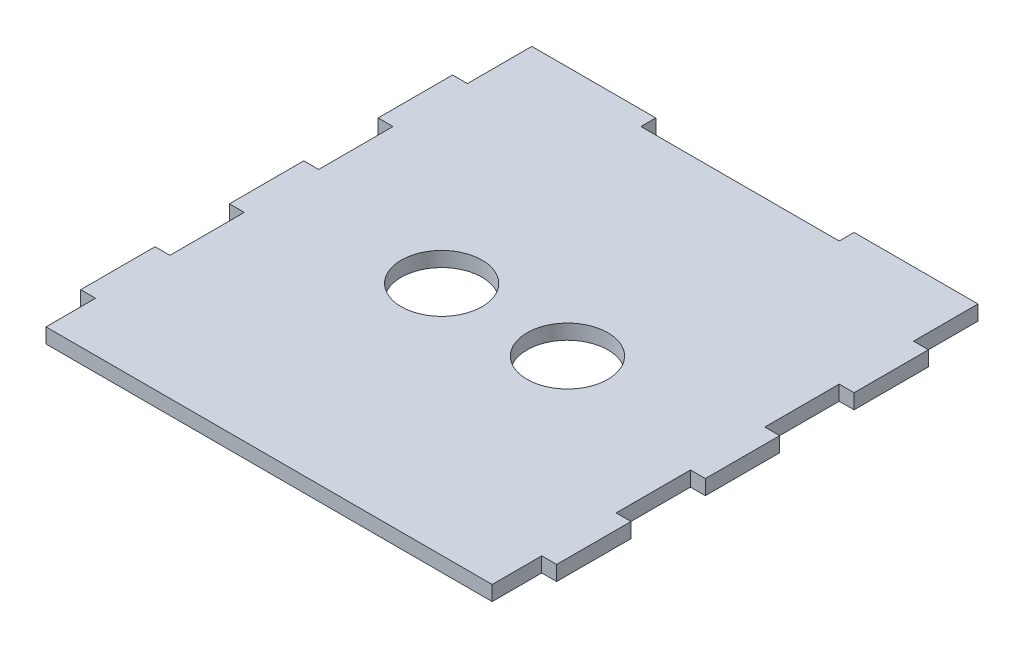
ISO-10303-21;
HEADER;
FILE_DESCRIPTION(('STEP AP214'),'2;1');
FILE_NAME('part.step','',(''),(''),'','','');
FILE_SCHEMA(('AUTOMOTIVE_DESIGN { 1 0 10303 214 1 1 1 1 }'));
ENDSEC;
DATA;
#1=APPLICATION_CONTEXT('core data for automotive mechanical design processes');
#2=APPLICATION_PROTOCOL_DEFINITION('international standard','automotive_design',2000,#1);
#3=PRODUCT_CONTEXT('',#1,'mechanical');
#4=PRODUCT('Part','Part','',(#3));
#5=PRODUCT_RELATED_PRODUCT_CATEGORY('part','',(#4));
#6=PRODUCT_DEFINITION_FORMATION('','',#4);
#7=PRODUCT_DEFINITION_CONTEXT('part definition',#1,'design');
#8=PRODUCT_DEFINITION('design','',#6,#7);
#9=PRODUCT_DEFINITION_SHAPE('','',#8);
#10=(LENGTH_UNIT() NAMED_UNIT(*) SI_UNIT(.MILLI.,.METRE.));
#11=(NAMED_UNIT(*) PLANE_ANGLE_UNIT() SI_UNIT($,.RADIAN.));
#12=(NAMED_UNIT(*) SI_UNIT($,.STERADIAN.) SOLID_ANGLE_UNIT());
#13=UNCERTAINTY_MEASURE_WITH_UNIT(LENGTH_MEASURE(1.E-05),#10,'distance_accuracy_value','');
#14=(GEOMETRIC_REPRESENTATION_CONTEXT(3) GLOBAL_UNCERTAINTY_ASSIGNED_CONTEXT((#13)) GLOBAL_UNIT_ASSIGNED_CONTEXT((#10,
#11,#12)) REPRESENTATION_CONTEXT('',''));
#15=CARTESIAN_POINT('',(0.,0.,0.));
#16=DIRECTION('',(0.,0.,1.));
#17=DIRECTION('',(1.,0.,0.));
#18=AXIS2_PLACEMENT_3D('',#15,#16,#17);
#19=CARTESIAN_POINT('',(0.,0.,-98.));
#20=DIRECTION('',(0.,0.,-1.));
#21=DIRECTION('',(-1.,0.,0.));
#22=AXIS2_PLACEMENT_3D('',#19,#20,#21);
#23=PLANE('',#22);
#24=DIRECTION('',(0.,1.,0.));
#25=VECTOR('',#24,1.);
#26=CARTESIAN_POINT('',(25.,0.,-98.));
#27=LINE('',#26,#25);
#28=CARTESIAN_POINT('',(25.,0.,-98.));
#29=VERTEX_POINT('',#28);
#30=CARTESIAN_POINT('',(25.,3.,-98.));
#31=VERTEX_POINT('',#30);
#32=EDGE_CURVE('E43',#29,#31,#27,.T.);
#33=ORIENTED_EDGE('',*,*,#32,.F.);
#34=DIRECTION('',(-1.,0.,0.));
#35=VECTOR('',#34,1.);
#36=CARTESIAN_POINT('',(0.,0.,-98.));
#37=LINE('',#36,#35);
#38=CARTESIAN_POINT('',(0.,0.,-98.));
#39=VERTEX_POINT('',#38);
#40=EDGE_CURVE('E281',#29,#39,#37,.T.);
#41=ORIENTED_EDGE('',*,*,#40,.T.);
#42=DIRECTION('',(0.,1.,0.));
#43=VECTOR('',#42,1.);
#44=CARTESIAN_POINT('',(0.,0.,-98.));
#45=LINE('',#44,#43);
#46=CARTESIAN_POINT('',(0.,3.,-98.));
#47=VERTEX_POINT('',#46);
#48=EDGE_CURVE('E284',#39,#47,#45,.T.);
#49=ORIENTED_EDGE('',*,*,#48,.T.);
#50=DIRECTION('',(-1.,0.,0.));
#51=VECTOR('',#50,1.);
#52=CARTESIAN_POINT('',(0.,3.,-98.));
#53=LINE('',#52,#51);
#54=EDGE_CURVE('E276',#31,#47,#53,.T.);
#55=ORIENTED_EDGE('',*,*,#54,.F.);
#56=EDGE_LOOP('',(#33,#41,#49,#55));
#57=FACE_BOUND('',#56,.T.);
#58=ADVANCED_FACE('F34',(#57),#23,.T.);
#59=CARTESIAN_POINT('',(90.,3.,0.));
#60=DIRECTION('',(-1.,0.,0.));
#61=DIRECTION('',(0.,0.,1.));
#62=AXIS2_PLACEMENT_3D('',#59,#60,#61);
#63=PLANE('',#62);
#64=DIRECTION('',(0.,0.,-1.));
#65=VECTOR('',#64,1.);
#66=CARTESIAN_POINT('',(90.,3.,0.));
#67=LINE('',#66,#65);
#68=CARTESIAN_POINT('',(90.,3.,-25.));
#69=VERTEX_POINT('',#68);
#70=CARTESIAN_POINT('',(90.,3.,-40.));
#71=VERTEX_POINT('',#70);
#72=EDGE_CURVE('E59',#69,#71,#67,.T.);
#73=ORIENTED_EDGE('',*,*,#72,.F.);
#74=DIRECTION('',(0.,1.,0.));
#75=VECTOR('',#74,1.);
#76=CARTESIAN_POINT('',(90.,0.,-25.));
#77=LINE('',#76,#75);
#78=CARTESIAN_POINT('',(90.,0.,-25.));
#79=VERTEX_POINT('',#78);
#80=EDGE_CURVE('E308',#79,#69,#77,.T.);
#81=ORIENTED_EDGE('',*,*,#80,.F.);
#82=DIRECTION('',(0.,0.,-1.));
#83=VECTOR('',#82,1.);
#84=CARTESIAN_POINT('',(90.,0.,0.));
#85=LINE('',#84,#83);
#86=CARTESIAN_POINT('',(90.,0.,-40.));
#87=VERTEX_POINT('',#86);
#88=EDGE_CURVE('E374',#79,#87,#85,.T.);
#89=ORIENTED_EDGE('',*,*,#88,.T.);
#90=DIRECTION('',(0.,1.,0.));
#91=VECTOR('',#90,1.);
#92=CARTESIAN_POINT('',(90.,0.,-40.));
#93=LINE('',#92,#91);
#94=EDGE_CURVE('E326',#87,#71,#93,.T.);
#95=ORIENTED_EDGE('',*,*,#94,.T.);
#96=EDGE_LOOP('',(#73,#81,#89,#95));
#97=FACE_BOUND('',#96,.T.);
#98=ADVANCED_FACE('F510',(#97),#63,.F.);
#99=CARTESIAN_POINT('',(90.,3.,-55.));
#100=VERTEX_POINT('',#99);
#101=CARTESIAN_POINT('',(90.,3.,-70.));
#102=VERTEX_POINT('',#101);
#103=EDGE_CURVE('E376',#100,#102,#67,.T.);
#104=ORIENTED_EDGE('',*,*,#103,.F.);
#105=DIRECTION('',(0.,1.,0.));
#106=VECTOR('',#105,1.);
#107=CARTESIAN_POINT('',(90.,0.,-55.));
#108=LINE('',#107,#106);
#109=CARTESIAN_POINT('',(90.,0.,-55.));
#110=VERTEX_POINT('',#109);
#111=EDGE_CURVE('E334',#110,#100,#108,.T.);
#112=ORIENTED_EDGE('',*,*,#111,.F.);
#113=CARTESIAN_POINT('',(90.,0.,-70.));
#114=VERTEX_POINT('',#113);
#115=EDGE_CURVE('E371',#110,#114,#85,.T.);
#116=ORIENTED_EDGE('',*,*,#115,.T.);
#117=DIRECTION('',(0.,1.,0.));
#118=VECTOR('',#117,1.);
#119=CARTESIAN_POINT('',(90.,0.,-70.));
#120=LINE('',#119,#118);
#121=EDGE_CURVE('E364',#114,#102,#120,.T.);
#122=ORIENTED_EDGE('',*,*,#121,.T.);
#123=EDGE_LOOP('',(#104,#112,#116,#122));
#124=FACE_BOUND('',#123,.T.);
#125=ADVANCED_FACE('F516',(#124),#63,.F.);
#126=DIRECTION('',(0.,1.,0.));
#127=VECTOR('',#126,1.);
#128=CARTESIAN_POINT('',(90.,0.,-85.));
#129=LINE('',#128,#127);
#130=CARTESIAN_POINT('',(90.,0.,-85.));
#131=VERTEX_POINT('',#130);
#132=CARTESIAN_POINT('',(90.,3.,-85.));
#133=VERTEX_POINT('',#132);
#134=EDGE_CURVE('E357',#131,#133,#129,.T.);
#135=ORIENTED_EDGE('',*,*,#134,.F.);
#136=CARTESIAN_POINT('',(90.,0.,-98.));
#137=VERTEX_POINT('',#136);
#138=EDGE_CURVE('E375',#131,#137,#85,.T.);
#139=ORIENTED_EDGE('',*,*,#138,.T.);
#140=DIRECTION('',(0.,1.,0.));
#141=VECTOR('',#140,1.);
#142=CARTESIAN_POINT('',(90.,0.,-98.));
#143=LINE('',#142,#141);
#144=CARTESIAN_POINT('',(90.,3.,-98.));
#145=VERTEX_POINT('',#144);
#146=EDGE_CURVE('E280',#137,#145,#143,.T.);
#147=ORIENTED_EDGE('',*,*,#146,.T.);
#148=EDGE_CURVE('E444',#133,#145,#67,.T.);
#149=ORIENTED_EDGE('',*,*,#148,.F.);
#150=EDGE_LOOP('',(#135,#139,#147,#149));
#151=FACE_BOUND('',#150,.T.);
#152=ADVANCED_FACE('F537',(#151),#63,.F.);
#153=CARTESIAN_POINT('',(0.,3.,0.));
#154=DIRECTION('',(-1.,0.,0.));
#155=DIRECTION('',(0.,0.,1.));
#156=AXIS2_PLACEMENT_3D('',#153,#154,#155);
#157=PLANE('',#156);
#158=DIRECTION('',(0.,1.,0.));
#159=VECTOR('',#158,1.);
#160=CARTESIAN_POINT('',(0.,0.,-25.));
#161=LINE('',#160,#159);
#162=CARTESIAN_POINT('',(0.,0.,-25.));
#163=VERTEX_POINT('',#162);
#164=CARTESIAN_POINT('',(0.,3.,-25.));
#165=VERTEX_POINT('',#164);
#166=EDGE_CURVE('E885',#163,#165,#161,.T.);
#167=ORIENTED_EDGE('',*,*,#166,.T.);
#168=DIRECTION('',(0.,0.,-1.));
#169=VECTOR('',#168,1.);
#170=CARTESIAN_POINT('',(0.,3.,0.));
#171=LINE('',#170,#169);
#172=CARTESIAN_POINT('',(0.,3.,-40.));
#173=VERTEX_POINT('',#172);
#174=EDGE_CURVE('E395',#165,#173,#171,.T.);
#175=ORIENTED_EDGE('',*,*,#174,.T.);
#176=DIRECTION('',(0.,1.,0.));
#177=VECTOR('',#176,1.);
#178=CARTESIAN_POINT('',(0.,0.,-40.));
#179=LINE('',#178,#177);
#180=CARTESIAN_POINT('',(0.,0.,-40.));
#181=VERTEX_POINT('',#180);
#182=EDGE_CURVE('E854',#181,#173,#179,.T.);
#183=ORIENTED_EDGE('',*,*,#182,.F.);
#184=DIRECTION('',(0.,0.,-1.));
#185=VECTOR('',#184,1.);
#186=CARTESIAN_POINT('',(0.,0.,0.));
#187=LINE('',#186,#185);
#188=EDGE_CURVE('E399',#163,#181,#187,.T.);
#189=ORIENTED_EDGE('',*,*,#188,.F.);
#190=EDGE_LOOP('',(#167,#175,#183,#189));
#191=FACE_BOUND('',#190,.T.);
#192=ADVANCED_FACE('F507',(#191),#157,.T.);
#193=DIRECTION('',(0.,1.,0.));
#194=VECTOR('',#193,1.);
#195=CARTESIAN_POINT('',(0.,0.,-55.));
#196=LINE('',#195,#194);
#197=CARTESIAN_POINT('',(0.,0.,-55.));
#198=VERTEX_POINT('',#197);
#199=CARTESIAN_POINT('',(0.,3.,-55.));
#200=VERTEX_POINT('',#199);
#201=EDGE_CURVE('E858',#198,#200,#196,.T.);
#202=ORIENTED_EDGE('',*,*,#201,.T.);
#203=CARTESIAN_POINT('',(0.,3.,-70.));
#204=VERTEX_POINT('',#203);
#205=EDGE_CURVE('E398',#200,#204,#171,.T.);
#206=ORIENTED_EDGE('',*,*,#205,.T.);
#207=DIRECTION('',(0.,1.,0.));
#208=VECTOR('',#207,1.);
#209=CARTESIAN_POINT('',(0.,0.,-70.));
#210=LINE('',#209,#208);
#211=CARTESIAN_POINT('',(0.,0.,-70.));
#212=VERTEX_POINT('',#211);
#213=EDGE_CURVE('E429',#212,#204,#210,.T.);
#214=ORIENTED_EDGE('',*,*,#213,.F.);
#215=EDGE_CURVE('E413',#198,#212,#187,.T.);
#216=ORIENTED_EDGE('',*,*,#215,.F.);
#217=EDGE_LOOP('',(#202,#206,#214,#216));
#218=FACE_BOUND('',#217,.T.);
#219=ADVANCED_FACE('F603',(#218),#157,.T.);
#220=CARTESIAN_POINT('',(0.,0.,-85.));
#221=VERTEX_POINT('',#220);
#222=EDGE_CURVE('E394',#221,#39,#187,.T.);
#223=ORIENTED_EDGE('',*,*,#222,.F.);
#224=DIRECTION('',(0.,1.,0.));
#225=VECTOR('',#224,1.);
#226=CARTESIAN_POINT('',(0.,0.,-85.));
#227=LINE('',#226,#225);
#228=CARTESIAN_POINT('',(0.,3.,-85.));
#229=VERTEX_POINT('',#228);
#230=EDGE_CURVE('E433',#221,#229,#227,.T.);
#231=ORIENTED_EDGE('',*,*,#230,.T.);
#232=EDGE_CURVE('E407',#229,#47,#171,.T.);
#233=ORIENTED_EDGE('',*,*,#232,.T.);
#234=ORIENTED_EDGE('',*,*,#48,.F.);
#235=EDGE_LOOP('',(#223,#231,#233,#234));
#236=FACE_BOUND('',#235,.T.);
#237=ADVANCED_FACE('F470',(#236),#157,.T.);
#238=CARTESIAN_POINT('',(0.,3.,0.));
#239=DIRECTION('',(0.,0.,-1.));
#240=DIRECTION('',(-1.,0.,0.));
#241=AXIS2_PLACEMENT_3D('',#238,#239,#240);
#242=PLANE('',#241);
#243=DIRECTION('',(1.,0.,0.));
#244=VECTOR('',#243,1.);
#245=CARTESIAN_POINT('',(0.,0.,0.));
#246=LINE('',#245,#244);
#247=CARTESIAN_POINT('',(0.,0.,0.));
#248=VERTEX_POINT('',#247);
#249=CARTESIAN_POINT('',(90.,0.,0.));
#250=VERTEX_POINT('',#249);
#251=EDGE_CURVE('E382',#248,#250,#246,.T.);
#252=ORIENTED_EDGE('',*,*,#251,.T.);
#253=DIRECTION('',(0.,-1.,0.));
#254=VECTOR('',#253,1.);
#255=CARTESIAN_POINT('',(90.,3.,0.));
#256=LINE('',#255,#254);
#257=CARTESIAN_POINT('',(90.,3.,0.));
#258=VERTEX_POINT('',#257);
#259=EDGE_CURVE('E458',#258,#250,#256,.T.);
#260=ORIENTED_EDGE('',*,*,#259,.F.);
#261=DIRECTION('',(1.,0.,0.));
#262=VECTOR('',#261,1.);
#263=CARTESIAN_POINT('',(0.,3.,0.));
#264=LINE('',#263,#262);
#265=CARTESIAN_POINT('',(0.,3.,0.));
#266=VERTEX_POINT('',#265);
#267=EDGE_CURVE('E442',#266,#258,#264,.T.);
#268=ORIENTED_EDGE('',*,*,#267,.F.);
#269=DIRECTION('',(0.,-1.,0.));
#270=VECTOR('',#269,1.);
#271=CARTESIAN_POINT('',(0.,3.,0.));
#272=LINE('',#271,#270);
#273=EDGE_CURVE('E842',#266,#248,#272,.T.);
#274=ORIENTED_EDGE('',*,*,#273,.T.);
#275=EDGE_LOOP('',(#252,#260,#268,#274));
#276=FACE_BOUND('',#275,.T.);
#277=ADVANCED_FACE('F36',(#276),#242,.F.);
#278=CARTESIAN_POINT('',(90.,0.,-10.));
#279=VERTEX_POINT('',#278);
#280=EDGE_CURVE('E392',#250,#279,#85,.T.);
#281=ORIENTED_EDGE('',*,*,#280,.T.);
#282=DIRECTION('',(0.,1.,0.));
#283=VECTOR('',#282,1.);
#284=CARTESIAN_POINT('',(90.,0.,-10.));
#285=LINE('',#284,#283);
#286=CARTESIAN_POINT('',(90.,3.,-10.));
#287=VERTEX_POINT('',#286);
#288=EDGE_CURVE('E300',#279,#287,#285,.T.);
#289=ORIENTED_EDGE('',*,*,#288,.T.);
#290=EDGE_CURVE('E920',#258,#287,#67,.T.);
#291=ORIENTED_EDGE('',*,*,#290,.F.);
#292=ORIENTED_EDGE('',*,*,#259,.T.);
#293=EDGE_LOOP('',(#281,#289,#291,#292));
#294=FACE_BOUND('',#293,.T.);
#295=ADVANCED_FACE('F504',(#294),#63,.F.);
#296=DIRECTION('',(0.,1.,0.));
#297=VECTOR('',#296,1.);
#298=CARTESIAN_POINT('',(0.,0.,-10.));
#299=LINE('',#298,#297);
#300=CARTESIAN_POINT('',(0.,0.,-10.));
#301=VERTEX_POINT('',#300);
#302=CARTESIAN_POINT('',(0.,3.,-10.));
#303=VERTEX_POINT('',#302);
#304=EDGE_CURVE('E882',#301,#303,#299,.T.);
#305=ORIENTED_EDGE('',*,*,#304,.F.);
#306=EDGE_CURVE('E445',#248,#301,#187,.T.);
#307=ORIENTED_EDGE('',*,*,#306,.F.);
#308=ORIENTED_EDGE('',*,*,#273,.F.);
#309=EDGE_CURVE('E397',#266,#303,#171,.T.);
#310=ORIENTED_EDGE('',*,*,#309,.T.);
#311=EDGE_LOOP('',(#305,#307,#308,#310));
#312=FACE_BOUND('',#311,.T.);
#313=ADVANCED_FACE('F495',(#312),#157,.T.);
#314=CARTESIAN_POINT('',(0.,3.,0.));
#315=DIRECTION('',(0.,1.,0.));
#316=DIRECTION('',(0.,0.,1.));
#317=AXIS2_PLACEMENT_3D('',#314,#315,#316);
#318=PLANE('',#317);
#319=CARTESIAN_POINT('',(57.69,3.,-47.5));
#320=DIRECTION('',(0.,1.,0.));
#321=DIRECTION('',(0.,0.,1.));
#322=AXIS2_PLACEMENT_3D('',#319,#320,#321);
#323=CIRCLE('',#322,8.15);
#324=CARTESIAN_POINT('',(57.69,3.,-39.35));
#325=VERTEX_POINT('',#324);
#326=EDGE_CURVE('E485',#325,#325,#323,.T.);
#327=ORIENTED_EDGE('',*,*,#326,.F.);
#328=EDGE_LOOP('',(#327));
#329=FACE_BOUND('',#328,.T.);
#330=CARTESIAN_POINT('',(32.31,3.,-47.5));
#331=DIRECTION('',(0.,1.,0.));
#332=DIRECTION('',(0.,0.,1.));
#333=AXIS2_PLACEMENT_3D('',#330,#331,#332);
#334=CIRCLE('',#333,8.15);
#335=CARTESIAN_POINT('',(32.31,3.,-39.35));
#336=VERTEX_POINT('',#335);
#337=EDGE_CURVE('E478',#336,#336,#334,.T.);
#338=ORIENTED_EDGE('',*,*,#337,.F.);
#339=EDGE_LOOP('',(#338));
#340=FACE_BOUND('',#339,.T.);
#341=DIRECTION('',(0.,0.,1.));
#342=VECTOR('',#341,1.);
#343=CARTESIAN_POINT('',(25.,3.,-98.));
#344=LINE('',#343,#342);
#345=CARTESIAN_POINT('',(25.,3.,-95.));
#346=VERTEX_POINT('',#345);
#347=EDGE_CURVE('E257',#31,#346,#344,.T.);
#348=ORIENTED_EDGE('',*,*,#347,.F.);
#349=ORIENTED_EDGE('',*,*,#54,.T.);
#350=ORIENTED_EDGE('',*,*,#232,.F.);
#351=DIRECTION('',(-1.,0.,0.));
#352=VECTOR('',#351,1.);
#353=CARTESIAN_POINT('',(-3.00000000000001,3.,-85.));
#354=LINE('',#353,#352);
#355=CARTESIAN_POINT('',(-3.00000000000001,3.,-85.));
#356=VERTEX_POINT('',#355);
#357=EDGE_CURVE('E420',#229,#356,#354,.T.);
#358=ORIENTED_EDGE('',*,*,#357,.T.);
#359=DIRECTION('',(0.,0.,1.));
#360=VECTOR('',#359,1.);
#361=CARTESIAN_POINT('',(-3.00000000000001,3.,-85.));
#362=LINE('',#361,#360);
#363=CARTESIAN_POINT('',(-3.00000000000001,3.,-70.));
#364=VERTEX_POINT('',#363);
#365=EDGE_CURVE('E421',#356,#364,#362,.T.);
#366=ORIENTED_EDGE('',*,*,#365,.T.);
#367=DIRECTION('',(1.,0.,0.));
#368=VECTOR('',#367,1.);
#369=CARTESIAN_POINT('',(-3.00000000000001,3.,-70.));
#370=LINE('',#369,#368);
#371=EDGE_CURVE('E417',#364,#204,#370,.T.);
#372=ORIENTED_EDGE('',*,*,#371,.T.);
#373=ORIENTED_EDGE('',*,*,#205,.F.);
#374=DIRECTION('',(-1.,0.,0.));
#375=VECTOR('',#374,1.);
#376=CARTESIAN_POINT('',(-3.,3.,-55.));
#377=LINE('',#376,#375);
#378=CARTESIAN_POINT('',(-3.,3.,-55.));
#379=VERTEX_POINT('',#378);
#380=EDGE_CURVE('E862',#200,#379,#377,.T.);
#381=ORIENTED_EDGE('',*,*,#380,.T.);
#382=DIRECTION('',(0.,0.,1.));
#383=VECTOR('',#382,1.);
#384=CARTESIAN_POINT('',(-3.,3.,-55.));
#385=LINE('',#384,#383);
#386=CARTESIAN_POINT('',(-3.,3.,-40.));
#387=VERTEX_POINT('',#386);
#388=EDGE_CURVE('E869',#379,#387,#385,.T.);
#389=ORIENTED_EDGE('',*,*,#388,.T.);
#390=DIRECTION('',(1.,0.,0.));
#391=VECTOR('',#390,1.);
#392=CARTESIAN_POINT('',(-3.,3.,-40.));
#393=LINE('',#392,#391);
#394=EDGE_CURVE('E866',#387,#173,#393,.T.);
#395=ORIENTED_EDGE('',*,*,#394,.T.);
#396=ORIENTED_EDGE('',*,*,#174,.F.);
#397=DIRECTION('',(-1.,0.,0.));
#398=VECTOR('',#397,1.);
#399=CARTESIAN_POINT('',(-3.,3.,-25.));
#400=LINE('',#399,#398);
#401=CARTESIAN_POINT('',(-3.,3.,-25.));
#402=VERTEX_POINT('',#401);
#403=EDGE_CURVE('E889',#165,#402,#400,.T.);
#404=ORIENTED_EDGE('',*,*,#403,.T.);
#405=DIRECTION('',(0.,0.,1.));
#406=VECTOR('',#405,1.);
#407=CARTESIAN_POINT('',(-3.,3.,-25.));
#408=LINE('',#407,#406);
#409=CARTESIAN_POINT('',(-3.,3.,-10.));
#410=VERTEX_POINT('',#409);
#411=EDGE_CURVE('E360',#402,#410,#408,.T.);
#412=ORIENTED_EDGE('',*,*,#411,.T.);
#413=DIRECTION('',(1.,0.,0.));
#414=VECTOR('',#413,1.);
#415=CARTESIAN_POINT('',(-3.,3.,-10.));
#416=LINE('',#415,#414);
#417=EDGE_CURVE('E893',#410,#303,#416,.T.);
#418=ORIENTED_EDGE('',*,*,#417,.T.);
#419=ORIENTED_EDGE('',*,*,#309,.F.);
#420=ORIENTED_EDGE('',*,*,#267,.T.);
#421=ORIENTED_EDGE('',*,*,#290,.T.);
#422=DIRECTION('',(1.,0.,0.));
#423=VECTOR('',#422,1.);
#424=CARTESIAN_POINT('',(90.,3.,-10.));
#425=LINE('',#424,#423);
#426=CARTESIAN_POINT('',(93.,3.,-10.));
#427=VERTEX_POINT('',#426);
#428=EDGE_CURVE('E287',#287,#427,#425,.T.);
#429=ORIENTED_EDGE('',*,*,#428,.T.);
#430=DIRECTION('',(0.,0.,-1.));
#431=VECTOR('',#430,1.);
#432=CARTESIAN_POINT('',(93.,3.,-25.));
#433=LINE('',#432,#431);
#434=CARTESIAN_POINT('',(93.,3.,-25.));
#435=VERTEX_POINT('',#434);
#436=EDGE_CURVE('E303',#427,#435,#433,.T.);
#437=ORIENTED_EDGE('',*,*,#436,.T.);
#438=DIRECTION('',(-1.,0.,0.));
#439=VECTOR('',#438,1.);
#440=CARTESIAN_POINT('',(90.,3.,-25.));
#441=LINE('',#440,#439);
#442=EDGE_CURVE('E294',#435,#69,#441,.T.);
#443=ORIENTED_EDGE('',*,*,#442,.T.);
#444=ORIENTED_EDGE('',*,*,#72,.T.);
#445=DIRECTION('',(1.,0.,0.));
#446=VECTOR('',#445,1.);
#447=CARTESIAN_POINT('',(90.,3.,-40.));
#448=LINE('',#447,#446);
#449=CARTESIAN_POINT('',(93.,3.,-40.));
#450=VERTEX_POINT('',#449);
#451=EDGE_CURVE('E310',#71,#450,#448,.T.);
#452=ORIENTED_EDGE('',*,*,#451,.T.);
#453=DIRECTION('',(0.,0.,-1.));
#454=VECTOR('',#453,1.);
#455=CARTESIAN_POINT('',(93.,3.,-55.));
#456=LINE('',#455,#454);
#457=CARTESIAN_POINT('',(93.,3.,-55.));
#458=VERTEX_POINT('',#457);
#459=EDGE_CURVE('E329',#450,#458,#456,.T.);
#460=ORIENTED_EDGE('',*,*,#459,.T.);
#461=DIRECTION('',(-1.,0.,0.));
#462=VECTOR('',#461,1.);
#463=CARTESIAN_POINT('',(90.,3.,-55.));
#464=LINE('',#463,#462);
#465=EDGE_CURVE('E320',#458,#100,#464,.T.);
#466=ORIENTED_EDGE('',*,*,#465,.T.);
#467=ORIENTED_EDGE('',*,*,#103,.T.);
#468=DIRECTION('',(1.,0.,0.));
#469=VECTOR('',#468,1.);
#470=CARTESIAN_POINT('',(90.,3.,-70.));
#471=LINE('',#470,#469);
#472=CARTESIAN_POINT('',(93.,3.,-70.));
#473=VERTEX_POINT('',#472);
#474=EDGE_CURVE('E337',#102,#473,#471,.T.);
#475=ORIENTED_EDGE('',*,*,#474,.T.);
#476=DIRECTION('',(0.,0.,-1.));
#477=VECTOR('',#476,1.);
#478=CARTESIAN_POINT('',(93.,3.,-85.));
#479=LINE('',#478,#477);
#480=CARTESIAN_POINT('',(93.,3.,-85.));
#481=VERTEX_POINT('',#480);
#482=EDGE_CURVE('E348',#473,#481,#479,.T.);
#483=ORIENTED_EDGE('',*,*,#482,.T.);
#484=DIRECTION('',(-1.,0.,0.));
#485=VECTOR('',#484,1.);
#486=CARTESIAN_POINT('',(90.,3.,-85.));
#487=LINE('',#486,#485);
#488=EDGE_CURVE('E351',#481,#133,#487,.T.);
#489=ORIENTED_EDGE('',*,*,#488,.T.);
#490=ORIENTED_EDGE('',*,*,#148,.T.);
#491=CARTESIAN_POINT('',(65.,3.,-98.));
#492=VERTEX_POINT('',#491);
#493=EDGE_CURVE('E282',#145,#492,#53,.T.);
#494=ORIENTED_EDGE('',*,*,#493,.T.);
#495=DIRECTION('',(0.,0.,-1.));
#496=VECTOR('',#495,1.);
#497=CARTESIAN_POINT('',(65.,3.,-98.));
#498=LINE('',#497,#496);
#499=CARTESIAN_POINT('',(65.,3.,-95.));
#500=VERTEX_POINT('',#499);
#501=EDGE_CURVE('E51',#500,#492,#498,.T.);
#502=ORIENTED_EDGE('',*,*,#501,.F.);
#503=DIRECTION('',(1.,0.,0.));
#504=VECTOR('',#503,1.);
#505=CARTESIAN_POINT('',(25.,3.,-95.));
#506=LINE('',#505,#504);
#507=EDGE_CURVE('E251',#346,#500,#506,.T.);
#508=ORIENTED_EDGE('',*,*,#507,.F.);
#509=EDGE_LOOP('',(#348,#349,#350,#358,#366,#372,#373,#381,#389,#395,#396,#404,#412,#418,#419,
#420,#421,#429,#437,#443,#444,#452,#460,#466,#467,#475,#483,#489,#490,#494,#502,#508));
#510=FACE_BOUND('',#509,.T.);
#511=ADVANCED_FACE('F264',(#329,#340,#510),#318,.T.);
#512=CARTESIAN_POINT('',(0.,0.,0.));
#513=DIRECTION('',(0.,1.,0.));
#514=DIRECTION('',(0.,0.,1.));
#515=AXIS2_PLACEMENT_3D('',#512,#513,#514);
#516=PLANE('',#515);
#517=CARTESIAN_POINT('',(57.69,0.,-47.5));
#518=DIRECTION('',(0.,1.,0.));
#519=DIRECTION('',(0.,0.,1.));
#520=AXIS2_PLACEMENT_3D('',#517,#518,#519);
#521=CIRCLE('',#520,8.15);
#522=CARTESIAN_POINT('',(57.69,0.,-39.35));
#523=VERTEX_POINT('',#522);
#524=EDGE_CURVE('E38',#523,#523,#521,.T.);
#525=ORIENTED_EDGE('',*,*,#524,.T.);
#526=EDGE_LOOP('',(#525));
#527=FACE_BOUND('',#526,.T.);
#528=CARTESIAN_POINT('',(32.31,0.,-47.5));
#529=DIRECTION('',(0.,1.,0.));
#530=DIRECTION('',(0.,0.,1.));
#531=AXIS2_PLACEMENT_3D('',#528,#529,#530);
#532=CIRCLE('',#531,8.15);
#533=CARTESIAN_POINT('',(32.31,0.,-39.35));
#534=VERTEX_POINT('',#533);
#535=EDGE_CURVE('E262',#534,#534,#532,.T.);
#536=ORIENTED_EDGE('',*,*,#535,.T.);
#537=EDGE_LOOP('',(#536));
#538=FACE_BOUND('',#537,.T.);
#539=ORIENTED_EDGE('',*,*,#40,.F.);
#540=DIRECTION('',(0.,0.,1.));
#541=VECTOR('',#540,1.);
#542=CARTESIAN_POINT('',(25.,0.,0.));
#543=LINE('',#542,#541);
#544=CARTESIAN_POINT('',(25.,0.,-95.));
#545=VERTEX_POINT('',#544);
#546=EDGE_CURVE('E274',#29,#545,#543,.T.);
#547=ORIENTED_EDGE('',*,*,#546,.T.);
#548=DIRECTION('',(1.,0.,0.));
#549=VECTOR('',#548,1.);
#550=CARTESIAN_POINT('',(0.,0.,-95.));
#551=LINE('',#550,#549);
#552=CARTESIAN_POINT('',(65.,0.,-95.));
#553=VERTEX_POINT('',#552);
#554=EDGE_CURVE('E11',#545,#553,#551,.T.);
#555=ORIENTED_EDGE('',*,*,#554,.T.);
#556=DIRECTION('',(0.,0.,-1.));
#557=VECTOR('',#556,1.);
#558=CARTESIAN_POINT('',(65.,0.,0.));
#559=LINE('',#558,#557);
#560=CARTESIAN_POINT('',(65.,0.,-98.));
#561=VERTEX_POINT('',#560);
#562=EDGE_CURVE('E270',#553,#561,#559,.T.);
#563=ORIENTED_EDGE('',*,*,#562,.T.);
#564=EDGE_CURVE('E277',#137,#561,#37,.T.);
#565=ORIENTED_EDGE('',*,*,#564,.F.);
#566=ORIENTED_EDGE('',*,*,#138,.F.);
#567=DIRECTION('',(-1.,0.,0.));
#568=VECTOR('',#567,1.);
#569=CARTESIAN_POINT('',(90.,0.,-85.));
#570=LINE('',#569,#568);
#571=CARTESIAN_POINT('',(93.,0.,-85.));
#572=VERTEX_POINT('',#571);
#573=EDGE_CURVE('E346',#572,#131,#570,.T.);
#574=ORIENTED_EDGE('',*,*,#573,.F.);
#575=DIRECTION('',(0.,0.,-1.));
#576=VECTOR('',#575,1.);
#577=CARTESIAN_POINT('',(93.,0.,-85.));
#578=LINE('',#577,#576);
#579=CARTESIAN_POINT('',(93.,0.,-70.));
#580=VERTEX_POINT('',#579);
#581=EDGE_CURVE('E343',#580,#572,#578,.T.);
#582=ORIENTED_EDGE('',*,*,#581,.F.);
#583=DIRECTION('',(1.,0.,0.));
#584=VECTOR('',#583,1.);
#585=CARTESIAN_POINT('',(90.,0.,-70.));
#586=LINE('',#585,#584);
#587=EDGE_CURVE('E347',#114,#580,#586,.T.);
#588=ORIENTED_EDGE('',*,*,#587,.F.);
#589=ORIENTED_EDGE('',*,*,#115,.F.);
#590=DIRECTION('',(-1.,0.,0.));
#591=VECTOR('',#590,1.);
#592=CARTESIAN_POINT('',(90.,0.,-55.));
#593=LINE('',#592,#591);
#594=CARTESIAN_POINT('',(93.,0.,-55.));
#595=VERTEX_POINT('',#594);
#596=EDGE_CURVE('E323',#595,#110,#593,.T.);
#597=ORIENTED_EDGE('',*,*,#596,.F.);
#598=DIRECTION('',(0.,0.,-1.));
#599=VECTOR('',#598,1.);
#600=CARTESIAN_POINT('',(93.,0.,-55.));
#601=LINE('',#600,#599);
#602=CARTESIAN_POINT('',(93.,0.,-40.));
#603=VERTEX_POINT('',#602);
#604=EDGE_CURVE('E319',#603,#595,#601,.T.);
#605=ORIENTED_EDGE('',*,*,#604,.F.);
#606=DIRECTION('',(1.,0.,0.));
#607=VECTOR('',#606,1.);
#608=CARTESIAN_POINT('',(90.,0.,-40.));
#609=LINE('',#608,#607);
#610=EDGE_CURVE('E316',#87,#603,#609,.T.);
#611=ORIENTED_EDGE('',*,*,#610,.F.);
#612=ORIENTED_EDGE('',*,*,#88,.F.);
#613=DIRECTION('',(-1.,0.,0.));
#614=VECTOR('',#613,1.);
#615=CARTESIAN_POINT('',(90.,0.,-25.));
#616=LINE('',#615,#614);
#617=CARTESIAN_POINT('',(93.,0.,-25.));
#618=VERTEX_POINT('',#617);
#619=EDGE_CURVE('E297',#618,#79,#616,.T.);
#620=ORIENTED_EDGE('',*,*,#619,.F.);
#621=DIRECTION('',(0.,0.,-1.));
#622=VECTOR('',#621,1.);
#623=CARTESIAN_POINT('',(93.,0.,-25.));
#624=LINE('',#623,#622);
#625=CARTESIAN_POINT('',(93.,0.,-10.));
#626=VERTEX_POINT('',#625);
#627=EDGE_CURVE('E293',#626,#618,#624,.T.);
#628=ORIENTED_EDGE('',*,*,#627,.F.);
#629=DIRECTION('',(1.,0.,0.));
#630=VECTOR('',#629,1.);
#631=CARTESIAN_POINT('',(90.,0.,-10.));
#632=LINE('',#631,#630);
#633=EDGE_CURVE('E290',#279,#626,#632,.T.);
#634=ORIENTED_EDGE('',*,*,#633,.F.);
#635=ORIENTED_EDGE('',*,*,#280,.F.);
#636=ORIENTED_EDGE('',*,*,#251,.F.);
#637=ORIENTED_EDGE('',*,*,#306,.T.);
#638=DIRECTION('',(1.,0.,0.));
#639=VECTOR('',#638,1.);
#640=CARTESIAN_POINT('',(-3.,0.,-10.));
#641=LINE('',#640,#639);
#642=CARTESIAN_POINT('',(-3.,0.,-10.));
#643=VERTEX_POINT('',#642);
#644=EDGE_CURVE('E900',#643,#301,#641,.T.);
#645=ORIENTED_EDGE('',*,*,#644,.F.);
#646=DIRECTION('',(0.,0.,1.));
#647=VECTOR('',#646,1.);
#648=CARTESIAN_POINT('',(-3.,0.,-25.));
#649=LINE('',#648,#647);
#650=CARTESIAN_POINT('',(-3.,0.,-25.));
#651=VERTEX_POINT('',#650);
#652=EDGE_CURVE('E892',#651,#643,#649,.T.);
#653=ORIENTED_EDGE('',*,*,#652,.F.);
#654=DIRECTION('',(-1.,0.,0.));
#655=VECTOR('',#654,1.);
#656=CARTESIAN_POINT('',(-3.,0.,-25.));
#657=LINE('',#656,#655);
#658=EDGE_CURVE('E883',#163,#651,#657,.T.);
#659=ORIENTED_EDGE('',*,*,#658,.F.);
#660=ORIENTED_EDGE('',*,*,#188,.T.);
#661=DIRECTION('',(1.,0.,0.));
#662=VECTOR('',#661,1.);
#663=CARTESIAN_POINT('',(-3.,0.,-40.));
#664=LINE('',#663,#662);
#665=CARTESIAN_POINT('',(-3.,0.,-40.));
#666=VERTEX_POINT('',#665);
#667=EDGE_CURVE('E875',#666,#181,#664,.T.);
#668=ORIENTED_EDGE('',*,*,#667,.F.);
#669=DIRECTION('',(0.,0.,1.));
#670=VECTOR('',#669,1.);
#671=CARTESIAN_POINT('',(-3.,0.,-55.));
#672=LINE('',#671,#670);
#673=CARTESIAN_POINT('',(-3.,0.,-55.));
#674=VERTEX_POINT('',#673);
#675=EDGE_CURVE('E865',#674,#666,#672,.T.);
#676=ORIENTED_EDGE('',*,*,#675,.F.);
#677=DIRECTION('',(-1.,0.,0.));
#678=VECTOR('',#677,1.);
#679=CARTESIAN_POINT('',(-3.,0.,-55.));
#680=LINE('',#679,#678);
#681=EDGE_CURVE('E855',#198,#674,#680,.T.);
#682=ORIENTED_EDGE('',*,*,#681,.F.);
#683=ORIENTED_EDGE('',*,*,#215,.T.);
#684=DIRECTION('',(1.,0.,0.));
#685=VECTOR('',#684,1.);
#686=CARTESIAN_POINT('',(-3.00000000000001,0.,-70.));
#687=LINE('',#686,#685);
#688=CARTESIAN_POINT('',(-3.00000000000001,0.,-70.));
#689=VERTEX_POINT('',#688);
#690=EDGE_CURVE('E424',#689,#212,#687,.T.);
#691=ORIENTED_EDGE('',*,*,#690,.F.);
#692=DIRECTION('',(0.,0.,1.));
#693=VECTOR('',#692,1.);
#694=CARTESIAN_POINT('',(-3.00000000000001,0.,-85.));
#695=LINE('',#694,#693);
#696=CARTESIAN_POINT('',(-3.00000000000001,0.,-85.));
#697=VERTEX_POINT('',#696);
#698=EDGE_CURVE('E428',#697,#689,#695,.T.);
#699=ORIENTED_EDGE('',*,*,#698,.F.);
#700=DIRECTION('',(-1.,0.,0.));
#701=VECTOR('',#700,1.);
#702=CARTESIAN_POINT('',(-3.00000000000001,0.,-85.));
#703=LINE('',#702,#701);
#704=EDGE_CURVE('E427',#221,#697,#703,.T.);
#705=ORIENTED_EDGE('',*,*,#704,.F.);
#706=ORIENTED_EDGE('',*,*,#222,.T.);
#707=EDGE_LOOP('',(#539,#547,#555,#563,#565,#566,#574,#582,#588,#589,#597,#605,#611,#612,#620,
#628,#634,#635,#636,#637,#645,#653,#659,#660,#668,#676,#682,#683,#691,#699,#705,#706));
#708=FACE_BOUND('',#707,.T.);
#709=ADVANCED_FACE('F464',(#527,#538,#708),#516,.F.);
#710=CARTESIAN_POINT('',(-3.00000000000001,0.,-85.));
#711=DIRECTION('',(-1.,0.,0.));
#712=DIRECTION('',(0.,0.,1.));
#713=AXIS2_PLACEMENT_3D('',#710,#711,#712);
#714=PLANE('',#713);
#715=ORIENTED_EDGE('',*,*,#365,.F.);
#716=DIRECTION('',(0.,1.,0.));
#717=VECTOR('',#716,1.);
#718=CARTESIAN_POINT('',(-3.00000000000001,0.,-85.));
#719=LINE('',#718,#717);
#720=EDGE_CURVE('E843',#697,#356,#719,.T.);
#721=ORIENTED_EDGE('',*,*,#720,.F.);
#722=ORIENTED_EDGE('',*,*,#698,.T.);
#723=DIRECTION('',(0.,1.,0.));
#724=VECTOR('',#723,1.);
#725=CARTESIAN_POINT('',(-3.00000000000001,0.,-70.));
#726=LINE('',#725,#724);
#727=EDGE_CURVE('E434',#689,#364,#726,.T.);
#728=ORIENTED_EDGE('',*,*,#727,.T.);
#729=EDGE_LOOP('',(#715,#721,#722,#728));
#730=FACE_BOUND('',#729,.T.);
#731=ADVANCED_FACE('F501',(#730),#714,.T.);
#732=CARTESIAN_POINT('',(-3.00000000000001,0.,-85.));
#733=DIRECTION('',(0.,0.,-1.));
#734=DIRECTION('',(-1.,0.,0.));
#735=AXIS2_PLACEMENT_3D('',#732,#733,#734);
#736=PLANE('',#735);
#737=ORIENTED_EDGE('',*,*,#357,.F.);
#738=ORIENTED_EDGE('',*,*,#230,.F.);
#739=ORIENTED_EDGE('',*,*,#704,.T.);
#740=ORIENTED_EDGE('',*,*,#720,.T.);
#741=EDGE_LOOP('',(#737,#738,#739,#740));
#742=FACE_BOUND('',#741,.T.);
#743=ADVANCED_FACE('F769',(#742),#736,.T.);
#744=CARTESIAN_POINT('',(-3.00000000000001,0.,-70.));
#745=DIRECTION('',(0.,0.,1.));
#746=DIRECTION('',(1.,0.,0.));
#747=AXIS2_PLACEMENT_3D('',#744,#745,#746);
#748=PLANE('',#747);
#749=ORIENTED_EDGE('',*,*,#371,.F.);
#750=ORIENTED_EDGE('',*,*,#727,.F.);
#751=ORIENTED_EDGE('',*,*,#690,.T.);
#752=ORIENTED_EDGE('',*,*,#213,.T.);
#753=EDGE_LOOP('',(#749,#750,#751,#752));
#754=FACE_BOUND('',#753,.T.);
#755=ADVANCED_FACE('F759',(#754),#748,.T.);
#756=CARTESIAN_POINT('',(-3.,0.,-55.));
#757=DIRECTION('',(-1.,0.,0.));
#758=DIRECTION('',(0.,0.,1.));
#759=AXIS2_PLACEMENT_3D('',#756,#757,#758);
#760=PLANE('',#759);
#761=ORIENTED_EDGE('',*,*,#388,.F.);
#762=DIRECTION('',(0.,1.,0.));
#763=VECTOR('',#762,1.);
#764=CARTESIAN_POINT('',(-3.,0.,-55.));
#765=LINE('',#764,#763);
#766=EDGE_CURVE('E849',#674,#379,#765,.T.);
#767=ORIENTED_EDGE('',*,*,#766,.F.);
#768=ORIENTED_EDGE('',*,*,#675,.T.);
#769=DIRECTION('',(0.,1.,0.));
#770=VECTOR('',#769,1.);
#771=CARTESIAN_POINT('',(-3.,0.,-40.));
#772=LINE('',#771,#770);
#773=EDGE_CURVE('E852',#666,#387,#772,.T.);
#774=ORIENTED_EDGE('',*,*,#773,.T.);
#775=EDGE_LOOP('',(#761,#767,#768,#774));
#776=FACE_BOUND('',#775,.T.);
#777=ADVANCED_FACE('F749',(#776),#760,.T.);
#778=CARTESIAN_POINT('',(-3.,0.,-55.));
#779=DIRECTION('',(0.,0.,-1.));
#780=DIRECTION('',(-1.,0.,0.));
#781=AXIS2_PLACEMENT_3D('',#778,#779,#780);
#782=PLANE('',#781);
#783=ORIENTED_EDGE('',*,*,#380,.F.);
#784=ORIENTED_EDGE('',*,*,#201,.F.);
#785=ORIENTED_EDGE('',*,*,#681,.T.);
#786=ORIENTED_EDGE('',*,*,#766,.T.);
#787=EDGE_LOOP('',(#783,#784,#785,#786));
#788=FACE_BOUND('',#787,.T.);
#789=ADVANCED_FACE('F739',(#788),#782,.T.);
#790=CARTESIAN_POINT('',(-3.,0.,-40.));
#791=DIRECTION('',(0.,0.,1.));
#792=DIRECTION('',(1.,0.,0.));
#793=AXIS2_PLACEMENT_3D('',#790,#791,#792);
#794=PLANE('',#793);
#795=ORIENTED_EDGE('',*,*,#394,.F.);
#796=ORIENTED_EDGE('',*,*,#773,.F.);
#797=ORIENTED_EDGE('',*,*,#667,.T.);
#798=ORIENTED_EDGE('',*,*,#182,.T.);
#799=EDGE_LOOP('',(#795,#796,#797,#798));
#800=FACE_BOUND('',#799,.T.);
#801=ADVANCED_FACE('F729',(#800),#794,.T.);
#802=CARTESIAN_POINT('',(-3.,0.,-25.));
#803=DIRECTION('',(-1.,0.,0.));
#804=DIRECTION('',(0.,0.,1.));
#805=AXIS2_PLACEMENT_3D('',#802,#803,#804);
#806=PLANE('',#805);
#807=ORIENTED_EDGE('',*,*,#411,.F.);
#808=DIRECTION('',(0.,1.,0.));
#809=VECTOR('',#808,1.);
#810=CARTESIAN_POINT('',(-3.,0.,-25.));
#811=LINE('',#810,#809);
#812=EDGE_CURVE('E872',#651,#402,#811,.T.);
#813=ORIENTED_EDGE('',*,*,#812,.F.);
#814=ORIENTED_EDGE('',*,*,#652,.T.);
#815=DIRECTION('',(0.,1.,0.));
#816=VECTOR('',#815,1.);
#817=CARTESIAN_POINT('',(-3.,0.,-10.));
#818=LINE('',#817,#816);
#819=EDGE_CURVE('E880',#643,#410,#818,.T.);
#820=ORIENTED_EDGE('',*,*,#819,.T.);
#821=EDGE_LOOP('',(#807,#813,#814,#820));
#822=FACE_BOUND('',#821,.T.);
#823=ADVANCED_FACE('F719',(#822),#806,.T.);
#824=CARTESIAN_POINT('',(-3.,0.,-25.));
#825=DIRECTION('',(0.,0.,-1.));
#826=DIRECTION('',(-1.,0.,0.));
#827=AXIS2_PLACEMENT_3D('',#824,#825,#826);
#828=PLANE('',#827);
#829=ORIENTED_EDGE('',*,*,#403,.F.);
#830=ORIENTED_EDGE('',*,*,#166,.F.);
#831=ORIENTED_EDGE('',*,*,#658,.T.);
#832=ORIENTED_EDGE('',*,*,#812,.T.);
#833=EDGE_LOOP('',(#829,#830,#831,#832));
#834=FACE_BOUND('',#833,.T.);
#835=ADVANCED_FACE('F709',(#834),#828,.T.);
#836=CARTESIAN_POINT('',(-3.,0.,-10.));
#837=DIRECTION('',(0.,0.,1.));
#838=DIRECTION('',(1.,0.,0.));
#839=AXIS2_PLACEMENT_3D('',#836,#837,#838);
#840=PLANE('',#839);
#841=ORIENTED_EDGE('',*,*,#417,.F.);
#842=ORIENTED_EDGE('',*,*,#819,.F.);
#843=ORIENTED_EDGE('',*,*,#644,.T.);
#844=ORIENTED_EDGE('',*,*,#304,.T.);
#845=EDGE_LOOP('',(#841,#842,#843,#844));
#846=FACE_BOUND('',#845,.T.);
#847=ADVANCED_FACE('F699',(#846),#840,.T.);
#848=CARTESIAN_POINT('',(90.,0.,-85.));
#849=DIRECTION('',(0.,0.,-1.));
#850=DIRECTION('',(-1.,0.,0.));
#851=AXIS2_PLACEMENT_3D('',#848,#849,#850);
#852=PLANE('',#851);
#853=ORIENTED_EDGE('',*,*,#488,.F.);
#854=DIRECTION('',(0.,1.,0.));
#855=VECTOR('',#854,1.);
#856=CARTESIAN_POINT('',(93.,0.,-85.));
#857=LINE('',#856,#855);
#858=EDGE_CURVE('E354',#572,#481,#857,.T.);
#859=ORIENTED_EDGE('',*,*,#858,.F.);
#860=ORIENTED_EDGE('',*,*,#573,.T.);
#861=ORIENTED_EDGE('',*,*,#134,.T.);
#862=EDGE_LOOP('',(#853,#859,#860,#861));
#863=FACE_BOUND('',#862,.T.);
#864=ADVANCED_FACE('F689',(#863),#852,.T.);
#865=CARTESIAN_POINT('',(93.,0.,-85.));
#866=DIRECTION('',(1.,0.,0.));
#867=DIRECTION('',(0.,0.,-1.));
#868=AXIS2_PLACEMENT_3D('',#865,#866,#867);
#869=PLANE('',#868);
#870=ORIENTED_EDGE('',*,*,#482,.F.);
#871=DIRECTION('',(0.,1.,0.));
#872=VECTOR('',#871,1.);
#873=CARTESIAN_POINT('',(93.,0.,-70.));
#874=LINE('',#873,#872);
#875=EDGE_CURVE('E905',#580,#473,#874,.T.);
#876=ORIENTED_EDGE('',*,*,#875,.F.);
#877=ORIENTED_EDGE('',*,*,#581,.T.);
#878=ORIENTED_EDGE('',*,*,#858,.T.);
#879=EDGE_LOOP('',(#870,#876,#877,#878));
#880=FACE_BOUND('',#879,.T.);
#881=ADVANCED_FACE('F679',(#880),#869,.T.);
#882=CARTESIAN_POINT('',(90.,0.,-70.));
#883=DIRECTION('',(0.,0.,1.));
#884=DIRECTION('',(1.,0.,0.));
#885=AXIS2_PLACEMENT_3D('',#882,#883,#884);
#886=PLANE('',#885);
#887=ORIENTED_EDGE('',*,*,#474,.F.);
#888=ORIENTED_EDGE('',*,*,#121,.F.);
#889=ORIENTED_EDGE('',*,*,#587,.T.);
#890=ORIENTED_EDGE('',*,*,#875,.T.);
#891=EDGE_LOOP('',(#887,#888,#889,#890));
#892=FACE_BOUND('',#891,.T.);
#893=ADVANCED_FACE('F669',(#892),#886,.T.);
#894=CARTESIAN_POINT('',(90.,0.,-55.));
#895=DIRECTION('',(0.,0.,-1.));
#896=DIRECTION('',(-1.,0.,0.));
#897=AXIS2_PLACEMENT_3D('',#894,#895,#896);
#898=PLANE('',#897);
#899=ORIENTED_EDGE('',*,*,#465,.F.);
#900=DIRECTION('',(0.,1.,0.));
#901=VECTOR('',#900,1.);
#902=CARTESIAN_POINT('',(93.,0.,-55.));
#903=LINE('',#902,#901);
#904=EDGE_CURVE('E338',#595,#458,#903,.T.);
#905=ORIENTED_EDGE('',*,*,#904,.F.);
#906=ORIENTED_EDGE('',*,*,#596,.T.);
#907=ORIENTED_EDGE('',*,*,#111,.T.);
#908=EDGE_LOOP('',(#899,#905,#906,#907));
#909=FACE_BOUND('',#908,.T.);
#910=ADVANCED_FACE('F659',(#909),#898,.T.);
#911=CARTESIAN_POINT('',(93.,0.,-55.));
#912=DIRECTION('',(1.,0.,0.));
#913=DIRECTION('',(0.,0.,-1.));
#914=AXIS2_PLACEMENT_3D('',#911,#912,#913);
#915=PLANE('',#914);
#916=ORIENTED_EDGE('',*,*,#459,.F.);
#917=DIRECTION('',(0.,1.,0.));
#918=VECTOR('',#917,1.);
#919=CARTESIAN_POINT('',(93.,0.,-40.));
#920=LINE('',#919,#918);
#921=EDGE_CURVE('E340',#603,#450,#920,.T.);
#922=ORIENTED_EDGE('',*,*,#921,.F.);
#923=ORIENTED_EDGE('',*,*,#604,.T.);
#924=ORIENTED_EDGE('',*,*,#904,.T.);
#925=EDGE_LOOP('',(#916,#922,#923,#924));
#926=FACE_BOUND('',#925,.T.);
#927=ADVANCED_FACE('F649',(#926),#915,.T.);
#928=CARTESIAN_POINT('',(90.,0.,-40.));
#929=DIRECTION('',(0.,0.,1.));
#930=DIRECTION('',(1.,0.,0.));
#931=AXIS2_PLACEMENT_3D('',#928,#929,#930);
#932=PLANE('',#931);
#933=ORIENTED_EDGE('',*,*,#451,.F.);
#934=ORIENTED_EDGE('',*,*,#94,.F.);
#935=ORIENTED_EDGE('',*,*,#610,.T.);
#936=ORIENTED_EDGE('',*,*,#921,.T.);
#937=EDGE_LOOP('',(#933,#934,#935,#936));
#938=FACE_BOUND('',#937,.T.);
#939=ADVANCED_FACE('F640',(#938),#932,.T.);
#940=CARTESIAN_POINT('',(90.,0.,-25.));
#941=DIRECTION('',(0.,0.,-1.));
#942=DIRECTION('',(-1.,0.,0.));
#943=AXIS2_PLACEMENT_3D('',#940,#941,#942);
#944=PLANE('',#943);
#945=ORIENTED_EDGE('',*,*,#442,.F.);
#946=DIRECTION('',(0.,1.,0.));
#947=VECTOR('',#946,1.);
#948=CARTESIAN_POINT('',(93.,0.,-25.));
#949=LINE('',#948,#947);
#950=EDGE_CURVE('E311',#618,#435,#949,.T.);
#951=ORIENTED_EDGE('',*,*,#950,.F.);
#952=ORIENTED_EDGE('',*,*,#619,.T.);
#953=ORIENTED_EDGE('',*,*,#80,.T.);
#954=EDGE_LOOP('',(#945,#951,#952,#953));
#955=FACE_BOUND('',#954,.T.);
#956=ADVANCED_FACE('F630',(#955),#944,.T.);
#957=CARTESIAN_POINT('',(93.,0.,-25.));
#958=DIRECTION('',(1.,0.,0.));
#959=DIRECTION('',(0.,0.,-1.));
#960=AXIS2_PLACEMENT_3D('',#957,#958,#959);
#961=PLANE('',#960);
#962=ORIENTED_EDGE('',*,*,#436,.F.);
#963=DIRECTION('',(0.,1.,0.));
#964=VECTOR('',#963,1.);
#965=CARTESIAN_POINT('',(93.,0.,-10.));
#966=LINE('',#965,#964);
#967=EDGE_CURVE('E313',#626,#427,#966,.T.);
#968=ORIENTED_EDGE('',*,*,#967,.F.);
#969=ORIENTED_EDGE('',*,*,#627,.T.);
#970=ORIENTED_EDGE('',*,*,#950,.T.);
#971=EDGE_LOOP('',(#962,#968,#969,#970));
#972=FACE_BOUND('',#971,.T.);
#973=ADVANCED_FACE('F527',(#972),#961,.T.);
#974=CARTESIAN_POINT('',(90.,0.,-10.));
#975=DIRECTION('',(0.,0.,1.));
#976=DIRECTION('',(1.,0.,0.));
#977=AXIS2_PLACEMENT_3D('',#974,#975,#976);
#978=PLANE('',#977);
#979=ORIENTED_EDGE('',*,*,#428,.F.);
#980=ORIENTED_EDGE('',*,*,#288,.F.);
#981=ORIENTED_EDGE('',*,*,#633,.T.);
#982=ORIENTED_EDGE('',*,*,#967,.T.);
#983=EDGE_LOOP('',(#979,#980,#981,#982));
#984=FACE_BOUND('',#983,.T.);
#985=ADVANCED_FACE('F520',(#984),#978,.T.);
#986=DIRECTION('',(0.,-1.,0.));
#987=VECTOR('',#986,1.);
#988=CARTESIAN_POINT('',(65.,0.,-98.));
#989=LINE('',#988,#987);
#990=EDGE_CURVE('E473',#492,#561,#989,.T.);
#991=ORIENTED_EDGE('',*,*,#990,.F.);
#992=ORIENTED_EDGE('',*,*,#493,.F.);
#993=ORIENTED_EDGE('',*,*,#146,.F.);
#994=ORIENTED_EDGE('',*,*,#564,.T.);
#995=EDGE_LOOP('',(#991,#992,#993,#994));
#996=FACE_BOUND('',#995,.T.);
#997=ADVANCED_FACE('F512',(#996),#23,.T.);
#998=CARTESIAN_POINT('',(25.,-1.,-95.));
#999=DIRECTION('',(0.,0.,1.));
#1000=DIRECTION('',(1.,0.,0.));
#1001=AXIS2_PLACEMENT_3D('',#998,#999,#1000);
#1002=PLANE('',#1001);
#1003=DIRECTION('',(0.,1.,0.));
#1004=VECTOR('',#1003,1.);
#1005=CARTESIAN_POINT('',(25.,-1.,-95.));
#1006=LINE('',#1005,#1004);
#1007=EDGE_CURVE('E246',#545,#346,#1006,.T.);
#1008=ORIENTED_EDGE('',*,*,#1007,.T.);
#1009=ORIENTED_EDGE('',*,*,#507,.T.);
#1010=DIRECTION('',(0.,1.,0.));
#1011=VECTOR('',#1010,1.);
#1012=CARTESIAN_POINT('',(65.,-1.,-95.));
#1013=LINE('',#1012,#1011);
#1014=EDGE_CURVE('E254',#553,#500,#1013,.T.);
#1015=ORIENTED_EDGE('',*,*,#1014,.F.);
#1016=ORIENTED_EDGE('',*,*,#554,.F.);
#1017=EDGE_LOOP('',(#1008,#1009,#1015,#1016));
#1018=FACE_BOUND('',#1017,.T.);
#1019=ADVANCED_FACE('F248',(#1018),#1002,.F.);
#1020=CARTESIAN_POINT('',(25.,-1.,-98.));
#1021=DIRECTION('',(-1.,0.,0.));
#1022=DIRECTION('',(0.,0.,1.));
#1023=AXIS2_PLACEMENT_3D('',#1020,#1021,#1022);
#1024=PLANE('',#1023);
#1025=ORIENTED_EDGE('',*,*,#32,.T.);
#1026=ORIENTED_EDGE('',*,*,#347,.T.);
#1027=ORIENTED_EDGE('',*,*,#1007,.F.);
#1028=ORIENTED_EDGE('',*,*,#546,.F.);
#1029=EDGE_LOOP('',(#1025,#1026,#1027,#1028));
#1030=FACE_BOUND('',#1029,.T.);
#1031=ADVANCED_FACE('F258',(#1030),#1024,.F.);
#1032=CARTESIAN_POINT('',(65.,-1.,-98.));
#1033=DIRECTION('',(1.,0.,0.));
#1034=DIRECTION('',(0.,0.,-1.));
#1035=AXIS2_PLACEMENT_3D('',#1032,#1033,#1034);
#1036=PLANE('',#1035);
#1037=ORIENTED_EDGE('',*,*,#1014,.T.);
#1038=ORIENTED_EDGE('',*,*,#501,.T.);
#1039=ORIENTED_EDGE('',*,*,#990,.T.);
#1040=ORIENTED_EDGE('',*,*,#562,.F.);
#1041=EDGE_LOOP('',(#1037,#1038,#1039,#1040));
#1042=FACE_BOUND('',#1041,.T.);
#1043=ADVANCED_FACE('F540',(#1042),#1036,.F.);
#1044=CARTESIAN_POINT('',(32.31,-5.00000000001367E-05,-47.5));
#1045=DIRECTION('',(0.,1.,0.));
#1046=DIRECTION('',(0.,0.,1.));
#1047=AXIS2_PLACEMENT_3D('',#1044,#1045,#1046);
#1048=CYLINDRICAL_SURFACE('',#1047,8.15);
#1049=ORIENTED_EDGE('',*,*,#337,.T.);
#1050=EDGE_LOOP('',(#1049));
#1051=FACE_BOUND('',#1050,.T.);
#1052=ORIENTED_EDGE('',*,*,#535,.F.);
#1053=EDGE_LOOP('',(#1052));
#1054=FACE_BOUND('',#1053,.T.);
#1055=ADVANCED_FACE('F542',(#1051,#1054),#1048,.F.);
#1056=CARTESIAN_POINT('',(57.69,-5.00000000001367E-05,-47.5));
#1057=DIRECTION('',(0.,1.,0.));
#1058=DIRECTION('',(0.,0.,1.));
#1059=AXIS2_PLACEMENT_3D('',#1056,#1057,#1058);
#1060=CYLINDRICAL_SURFACE('',#1059,8.15);
#1061=ORIENTED_EDGE('',*,*,#326,.T.);
#1062=EDGE_LOOP('',(#1061));
#1063=FACE_BOUND('',#1062,.T.);
#1064=ORIENTED_EDGE('',*,*,#524,.F.);
#1065=EDGE_LOOP('',(#1064));
#1066=FACE_BOUND('',#1065,.T.);
#1067=ADVANCED_FACE('F490',(#1063,#1066),#1060,.F.);
#1068=CLOSED_SHELL('',(#58,#98,#125,#152,#192,#219,#237,#277,#295,#313,#511,#709,#731,#743,#755,
#777,#789,#801,#823,#835,#847,#864,#881,#893,#910,#927,#939,#956,#973,#985,#997,#1019,#1031,
#1043,#1055,#1067));
#1069=MANIFOLD_SOLID_BREP('B2',#1068);
#1070=ADVANCED_BREP_SHAPE_REPRESENTATION('',(#18,#1069),#14);
#1071=SHAPE_DEFINITION_REPRESENTATION(#9,#1070);
ENDSEC;
END-ISO-10303-21;
